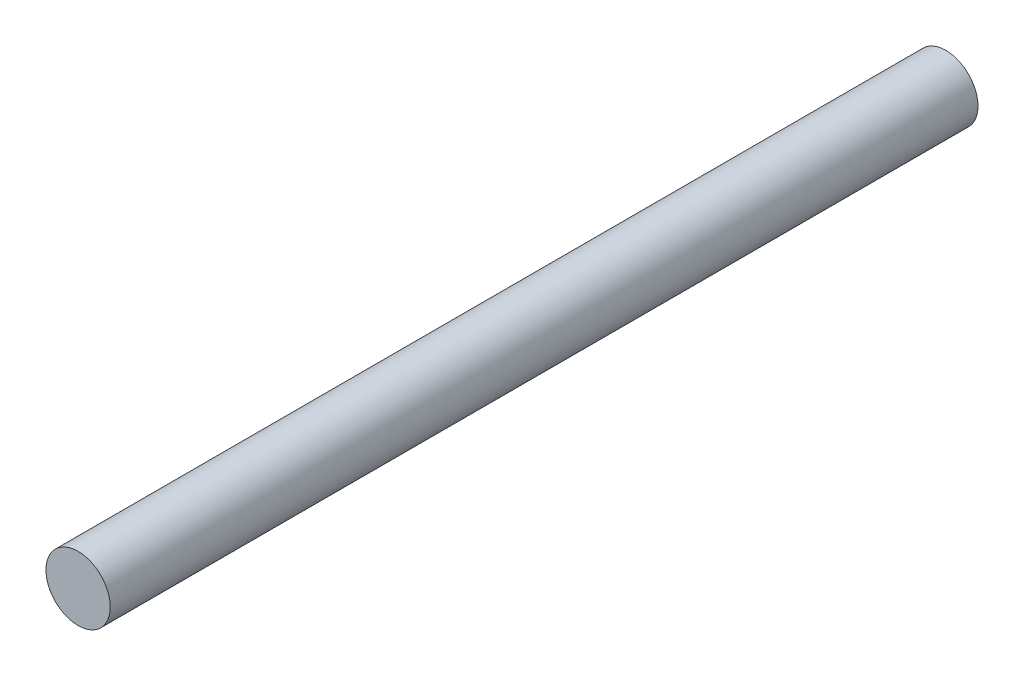
ISO-10303-21;
HEADER;
FILE_DESCRIPTION(('STEP AP214'),'2;1');
FILE_NAME('part.step','',(''),(''),'','','');
FILE_SCHEMA(('AUTOMOTIVE_DESIGN { 1 0 10303 214 1 1 1 1 }'));
ENDSEC;
DATA;
#1=APPLICATION_CONTEXT('core data for automotive mechanical design processes');
#2=APPLICATION_PROTOCOL_DEFINITION('international standard','automotive_design',2000,#1);
#3=PRODUCT_CONTEXT('',#1,'mechanical');
#4=PRODUCT('Part','Part','',(#3));
#5=PRODUCT_RELATED_PRODUCT_CATEGORY('part','',(#4));
#6=PRODUCT_DEFINITION_FORMATION('','',#4);
#7=PRODUCT_DEFINITION_CONTEXT('part definition',#1,'design');
#8=PRODUCT_DEFINITION('design','',#6,#7);
#9=PRODUCT_DEFINITION_SHAPE('','',#8);
#10=(LENGTH_UNIT() NAMED_UNIT(*) SI_UNIT(.MILLI.,.METRE.));
#11=(NAMED_UNIT(*) PLANE_ANGLE_UNIT() SI_UNIT($,.RADIAN.));
#12=(NAMED_UNIT(*) SI_UNIT($,.STERADIAN.) SOLID_ANGLE_UNIT());
#13=UNCERTAINTY_MEASURE_WITH_UNIT(LENGTH_MEASURE(1.E-05),#10,'distance_accuracy_value','');
#14=(GEOMETRIC_REPRESENTATION_CONTEXT(3) GLOBAL_UNCERTAINTY_ASSIGNED_CONTEXT((#13)) GLOBAL_UNIT_ASSIGNED_CONTEXT((#10,
#11,#12)) REPRESENTATION_CONTEXT('',''));
#15=CARTESIAN_POINT('',(0.,0.,0.));
#16=DIRECTION('',(0.,0.,1.));
#17=DIRECTION('',(1.,0.,0.));
#18=AXIS2_PLACEMENT_3D('',#15,#16,#17);
#19=CARTESIAN_POINT('',(0.,0.,107.95));
#20=DIRECTION('',(0.,0.,-1.));
#21=DIRECTION('',(-1.,0.,0.));
#22=AXIS2_PLACEMENT_3D('',#19,#20,#21);
#23=CYLINDRICAL_SURFACE('',#22,4.);
#24=CARTESIAN_POINT('',(0.,0.,107.95));
#25=DIRECTION('',(0.,0.,1.));
#26=DIRECTION('',(1.,0.,0.));
#27=AXIS2_PLACEMENT_3D('',#24,#25,#26);
#28=CIRCLE('',#27,4.);
#29=CARTESIAN_POINT('',(4.,0.,107.95));
#30=VERTEX_POINT('',#29);
#31=EDGE_CURVE('E10',#30,#30,#28,.T.);
#32=ORIENTED_EDGE('',*,*,#31,.F.);
#33=EDGE_LOOP('',(#32));
#34=FACE_BOUND('',#33,.T.);
#35=CARTESIAN_POINT('',(0.,0.,0.));
#36=DIRECTION('',(0.,0.,1.));
#37=DIRECTION('',(1.,0.,0.));
#38=AXIS2_PLACEMENT_3D('',#35,#36,#37);
#39=CIRCLE('',#38,4.);
#40=CARTESIAN_POINT('',(4.,0.,0.));
#41=VERTEX_POINT('',#40);
#42=EDGE_CURVE('E34',#41,#41,#39,.T.);
#43=ORIENTED_EDGE('',*,*,#42,.T.);
#44=EDGE_LOOP('',(#43));
#45=FACE_BOUND('',#44,.T.);
#46=ADVANCED_FACE('F31',(#34,#45),#23,.T.);
#47=CARTESIAN_POINT('',(0.,0.,107.95));
#48=DIRECTION('',(0.,0.,1.));
#49=DIRECTION('',(1.,0.,0.));
#50=AXIS2_PLACEMENT_3D('',#47,#48,#49);
#51=PLANE('',#50);
#52=ORIENTED_EDGE('',*,*,#31,.T.);
#53=EDGE_LOOP('',(#52));
#54=FACE_BOUND('',#53,.T.);
#55=ADVANCED_FACE('F46',(#54),#51,.T.);
#56=CARTESIAN_POINT('',(0.,0.,0.));
#57=DIRECTION('',(0.,0.,1.));
#58=DIRECTION('',(1.,0.,0.));
#59=AXIS2_PLACEMENT_3D('',#56,#57,#58);
#60=PLANE('',#59);
#61=ORIENTED_EDGE('',*,*,#42,.F.);
#62=EDGE_LOOP('',(#61));
#63=FACE_BOUND('',#62,.T.);
#64=ADVANCED_FACE('F44',(#63),#60,.F.);
#65=CLOSED_SHELL('',(#46,#55,#64));
#66=MANIFOLD_SOLID_BREP('B2',#65);
#67=ADVANCED_BREP_SHAPE_REPRESENTATION('',(#18,#66),#14);
#68=SHAPE_DEFINITION_REPRESENTATION(#9,#67);
ENDSEC;
END-ISO-10303-21;
